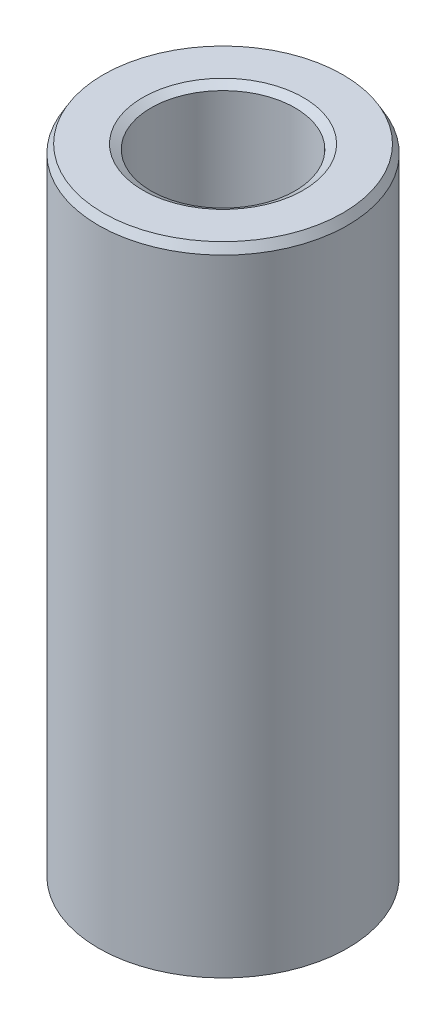
ISO-10303-21;
HEADER;
FILE_DESCRIPTION(('STEP AP214'),'2;1');
FILE_NAME('part.step','',(''),(''),'','','');
FILE_SCHEMA(('AUTOMOTIVE_DESIGN { 1 0 10303 214 1 1 1 1 }'));
ENDSEC;
DATA;
#1=APPLICATION_CONTEXT('core data for automotive mechanical design processes');
#2=APPLICATION_PROTOCOL_DEFINITION('international standard','automotive_design',2000,#1);
#3=PRODUCT_CONTEXT('',#1,'mechanical');
#4=PRODUCT('Part','Part','',(#3));
#5=PRODUCT_RELATED_PRODUCT_CATEGORY('part','',(#4));
#6=PRODUCT_DEFINITION_FORMATION('','',#4);
#7=PRODUCT_DEFINITION_CONTEXT('part definition',#1,'design');
#8=PRODUCT_DEFINITION('design','',#6,#7);
#9=PRODUCT_DEFINITION_SHAPE('','',#8);
#10=(LENGTH_UNIT() NAMED_UNIT(*) SI_UNIT(.MILLI.,.METRE.));
#11=(NAMED_UNIT(*) PLANE_ANGLE_UNIT() SI_UNIT($,.RADIAN.));
#12=(NAMED_UNIT(*) SI_UNIT($,.STERADIAN.) SOLID_ANGLE_UNIT());
#13=UNCERTAINTY_MEASURE_WITH_UNIT(LENGTH_MEASURE(1.E-05),#10,'distance_accuracy_value','');
#14=(GEOMETRIC_REPRESENTATION_CONTEXT(3) GLOBAL_UNCERTAINTY_ASSIGNED_CONTEXT((#13)) GLOBAL_UNIT_ASSIGNED_CONTEXT((#10,
#11,#12)) REPRESENTATION_CONTEXT('',''));
#15=CARTESIAN_POINT('',(0.,0.,0.));
#16=DIRECTION('',(0.,0.,1.));
#17=DIRECTION('',(1.,0.,0.));
#18=AXIS2_PLACEMENT_3D('',#15,#16,#17);
#19=CARTESIAN_POINT('',(0.,89.7518243447948,0.));
#20=DIRECTION('',(0.,-1.,0.));
#21=DIRECTION('',(0.,0.,-1.));
#22=AXIS2_PLACEMENT_3D('',#19,#20,#21);
#23=CYLINDRICAL_SURFACE('',#22,17.5);
#24=CARTESIAN_POINT('',(0.,0.672825133699442,0.));
#25=DIRECTION('',(0.,1.,0.));
#26=DIRECTION('',(0.,0.,1.));
#27=AXIS2_PLACEMENT_3D('',#24,#25,#26);
#28=CIRCLE('',#27,17.5);
#29=CARTESIAN_POINT('',(0.,0.672825133699442,17.5));
#30=VERTEX_POINT('',#29);
#31=EDGE_CURVE('E10',#30,#30,#28,.T.);
#32=ORIENTED_EDGE('',*,*,#31,.T.);
#33=EDGE_LOOP('',(#32));
#34=FACE_BOUND('',#33,.T.);
#35=CARTESIAN_POINT('',(0.,88.586457028618,0.));
#36=DIRECTION('',(0.,1.,0.));
#37=DIRECTION('',(0.,0.,1.));
#38=AXIS2_PLACEMENT_3D('',#35,#36,#37);
#39=CIRCLE('',#38,17.5);
#40=CARTESIAN_POINT('',(0.,88.586457028618,17.5));
#41=VERTEX_POINT('',#40);
#42=EDGE_CURVE('E50',#41,#41,#39,.F.);
#43=ORIENTED_EDGE('',*,*,#42,.T.);
#44=EDGE_LOOP('',(#43));
#45=FACE_BOUND('',#44,.T.);
#46=ADVANCED_FACE('F39',(#34,#45),#23,.T.);
#47=CARTESIAN_POINT('',(0.,89.7518243447948,0.));
#48=DIRECTION('',(0.,1.,0.));
#49=DIRECTION('',(0.,0.,1.));
#50=AXIS2_PLACEMENT_3D('',#47,#48,#49);
#51=PLANE('',#50);
#52=CARTESIAN_POINT('',(0.,89.7518243447948,0.));
#53=DIRECTION('',(0.,1.,0.));
#54=DIRECTION('',(0.,0.,1.));
#55=AXIS2_PLACEMENT_3D('',#52,#53,#54);
#56=CIRCLE('',#55,11.2804447194048);
#57=CARTESIAN_POINT('',(0.,89.7518243447948,11.2804447194048));
#58=VERTEX_POINT('',#57);
#59=EDGE_CURVE('E58',#58,#58,#56,.F.);
#60=ORIENTED_EDGE('',*,*,#59,.T.);
#61=EDGE_LOOP('',(#60));
#62=FACE_BOUND('',#61,.T.);
#63=CARTESIAN_POINT('',(0.,89.7518243447948,0.));
#64=DIRECTION('',(0.,1.,0.));
#65=DIRECTION('',(0.,0.,1.));
#66=AXIS2_PLACEMENT_3D('',#63,#64,#65);
#67=CIRCLE('',#66,16.8271748663005);
#68=CARTESIAN_POINT('',(0.,89.7518243447948,16.8271748663005));
#69=VERTEX_POINT('',#68);
#70=EDGE_CURVE('E61',#69,#69,#67,.T.);
#71=ORIENTED_EDGE('',*,*,#70,.T.);
#72=EDGE_LOOP('',(#71));
#73=FACE_BOUND('',#72,.T.);
#74=ADVANCED_FACE('F88',(#62,#73),#51,.T.);
#75=CARTESIAN_POINT('',(0.,0.,0.));
#76=DIRECTION('',(0.,1.,0.));
#77=DIRECTION('',(0.,0.,1.));
#78=AXIS2_PLACEMENT_3D('',#75,#76,#77);
#79=PLANE('',#78);
#80=CARTESIAN_POINT('',(0.,0.,0.));
#81=DIRECTION('',(0.,1.,0.));
#82=DIRECTION('',(0.,0.,1.));
#83=AXIS2_PLACEMENT_3D('',#80,#81,#82);
#84=CIRCLE('',#83,10.7879025369275);
#85=CARTESIAN_POINT('',(0.,0.,10.7879025369275));
#86=VERTEX_POINT('',#85);
#87=EDGE_CURVE('E51',#86,#86,#84,.T.);
#88=ORIENTED_EDGE('',*,*,#87,.T.);
#89=EDGE_LOOP('',(#88));
#90=FACE_BOUND('',#89,.T.);
#91=CARTESIAN_POINT('',(0.,0.,0.));
#92=DIRECTION('',(0.,1.,0.));
#93=DIRECTION('',(0.,0.,1.));
#94=AXIS2_PLACEMENT_3D('',#91,#92,#93);
#95=CIRCLE('',#94,16.3346326838232);
#96=CARTESIAN_POINT('',(0.,0.,16.3346326838232));
#97=VERTEX_POINT('',#96);
#98=EDGE_CURVE('E54',#97,#97,#95,.F.);
#99=ORIENTED_EDGE('',*,*,#98,.T.);
#100=EDGE_LOOP('',(#99));
#101=FACE_BOUND('',#100,.T.);
#102=ADVANCED_FACE('F83',(#90,#101),#79,.F.);
#103=CARTESIAN_POINT('',(0.,89.7518243447948,0.));
#104=DIRECTION('',(0.,-1.,0.));
#105=DIRECTION('',(0.,0.,-1.));
#106=AXIS2_PLACEMENT_3D('',#103,#104,#105);
#107=CYLINDRICAL_SURFACE('',#106,10.1150774032281);
#108=CARTESIAN_POINT('',(0.,89.0789992110954,0.));
#109=DIRECTION('',(0.,1.,0.));
#110=DIRECTION('',(0.,0.,1.));
#111=AXIS2_PLACEMENT_3D('',#108,#109,#110);
#112=CIRCLE('',#111,10.1150774032281);
#113=CARTESIAN_POINT('',(0.,89.0789992110953,10.1150774032281));
#114=VERTEX_POINT('',#113);
#115=EDGE_CURVE('E67',#114,#114,#112,.T.);
#116=ORIENTED_EDGE('',*,*,#115,.T.);
#117=EDGE_LOOP('',(#116));
#118=FACE_BOUND('',#117,.T.);
#119=CARTESIAN_POINT('',(0.,1.16536731617678,0.));
#120=DIRECTION('',(0.,1.,0.));
#121=DIRECTION('',(0.,0.,1.));
#122=AXIS2_PLACEMENT_3D('',#119,#120,#121);
#123=CIRCLE('',#122,10.1150774032281);
#124=CARTESIAN_POINT('',(0.,1.16536731617678,10.1150774032281));
#125=VERTEX_POINT('',#124);
#126=EDGE_CURVE('E69',#125,#125,#123,.F.);
#127=ORIENTED_EDGE('',*,*,#126,.T.);
#128=EDGE_LOOP('',(#127));
#129=FACE_BOUND('',#128,.T.);
#130=ADVANCED_FACE('F71',(#118,#129),#107,.F.);
#131=CARTESIAN_POINT('',(0.,89.0789992110954,0.));
#132=DIRECTION('',(0.,1.,0.));
#133=DIRECTION('',(0.,0.,1.));
#134=AXIS2_PLACEMENT_3D('',#131,#132,#133);
#135=CONICAL_SURFACE('',#134,10.1150774032281,1.0471975511966);
#136=CARTESIAN_POINT('',(0.,89.7518243447948,11.2804447194048));
#137=CARTESIAN_POINT('',(0.,89.7448157496521,11.268305476528));
#138=CARTESIAN_POINT('',(0.,89.7378071545094,11.2561662336511));
#139=CARTESIAN_POINT('',(0.,89.723789964224,11.2318877478975));
#140=CARTESIAN_POINT('',(0.,89.7167813690813,11.2197485050206));
#141=CARTESIAN_POINT('',(0.,89.7027641787959,11.1954700192669));
#142=CARTESIAN_POINT('',(0.,89.6957555836532,11.1833307763901));
#143=CARTESIAN_POINT('',(0.,89.6817383933678,11.1590522906364));
#144=CARTESIAN_POINT('',(0.,89.674729798225,11.1469130477596));
#145=CARTESIAN_POINT('',(0.,89.6607126079396,11.1226345620059));
#146=CARTESIAN_POINT('',(0.,89.653704012797,11.1104953191291));
#147=CARTESIAN_POINT('',(0.,89.6396868225115,11.0862168333754));
#148=CARTESIAN_POINT('',(0.,89.6326782273688,11.0740775904985));
#149=CARTESIAN_POINT('',(0.,89.6186610370834,11.0497991047448));
#150=CARTESIAN_POINT('',(0.,89.6116524419407,11.037659861868));
#151=CARTESIAN_POINT('',(0.,89.5976352516553,11.0133813761143));
#152=CARTESIAN_POINT('',(0.,89.5906266565126,11.0012421332375));
#153=CARTESIAN_POINT('',(0.,89.5766094662272,10.9769636474838));
#154=CARTESIAN_POINT('',(0.,89.5696008710845,10.964824404607));
#155=CARTESIAN_POINT('',(0.,89.5555836807991,10.9405459188533));
#156=CARTESIAN_POINT('',(0.,89.5485750856564,10.9284066759764));
#157=CARTESIAN_POINT('',(0.,89.534557895371,10.9041281902228));
#158=CARTESIAN_POINT('',(0.,89.5275493002283,10.8919889473459));
#159=CARTESIAN_POINT('',(0.,89.5135321099429,10.8677104615922));
#160=CARTESIAN_POINT('',(0.,89.5065235148002,10.8555712187154));
#161=CARTESIAN_POINT('',(0.,89.4925063245148,10.8312927329617));
#162=CARTESIAN_POINT('',(0.,89.4854977293721,10.8191534900849));
#163=CARTESIAN_POINT('',(0.,89.4714805390867,10.7948750043312));
#164=CARTESIAN_POINT('',(0.,89.464471943944,10.7827357614543));
#165=CARTESIAN_POINT('',(0.,89.4504547536586,10.7584572757007));
#166=CARTESIAN_POINT('',(0.,89.4434461585159,10.7463180328238));
#167=CARTESIAN_POINT('',(0.,89.4294289682305,10.7220395470701));
#168=CARTESIAN_POINT('',(0.,89.4224203730878,10.7099003041933));
#169=CARTESIAN_POINT('',(0.,89.4084031828024,10.6856218184396));
#170=CARTESIAN_POINT('',(0.,89.4013945876597,10.6734825755628));
#171=CARTESIAN_POINT('',(0.,89.3873773973743,10.6492040898091));
#172=CARTESIAN_POINT('',(0.,89.3803688022315,10.6370648469322));
#173=CARTESIAN_POINT('',(0.,89.3663516119461,10.6127863611786));
#174=CARTESIAN_POINT('',(0.,89.3593430168034,10.6006471183017));
#175=CARTESIAN_POINT('',(0.,89.345325826518,10.576368632548));
#176=CARTESIAN_POINT('',(0.,89.3383172313753,10.5642293896712));
#177=CARTESIAN_POINT('',(0.,89.3243000410899,10.5399509039175));
#178=CARTESIAN_POINT('',(0.,89.3172914459472,10.5278116610407));
#179=CARTESIAN_POINT('',(0.,89.3032742556618,10.503533175287));
#180=CARTESIAN_POINT('',(0.,89.2962656605191,10.4913939324102));
#181=CARTESIAN_POINT('',(0.,89.2822484702337,10.4671154466565));
#182=CARTESIAN_POINT('',(0.,89.275239875091,10.4549762037796));
#183=CARTESIAN_POINT('',(0.,89.2612226848056,10.430697718026));
#184=CARTESIAN_POINT('',(0.,89.2542140896629,10.4185584751491));
#185=CARTESIAN_POINT('',(0.,89.2401968993775,10.3942799893954));
#186=CARTESIAN_POINT('',(0.,89.2331883042348,10.3821407465186));
#187=CARTESIAN_POINT('',(0.,89.2191711139494,10.3578622607649));
#188=CARTESIAN_POINT('',(0.,89.2121625188067,10.3457230178881));
#189=CARTESIAN_POINT('',(0.,89.1981453285213,10.3214445321344));
#190=CARTESIAN_POINT('',(0.,89.1911367333786,10.3093052892575));
#191=CARTESIAN_POINT('',(0.,89.1771195430932,10.2850268035039));
#192=CARTESIAN_POINT('',(0.,89.1701109479505,10.272887560627));
#193=CARTESIAN_POINT('',(0.,89.1560937576651,10.2486090748733));
#194=CARTESIAN_POINT('',(0.,89.1490851625224,10.2364698319965));
#195=CARTESIAN_POINT('',(0.,89.135067972237,10.2121913462428));
#196=CARTESIAN_POINT('',(0.,89.1280593770943,10.200052103366));
#197=CARTESIAN_POINT('',(0.,89.1140421868089,10.1757736176123));
#198=CARTESIAN_POINT('',(0.,89.1070335916662,10.1636343747354));
#199=CARTESIAN_POINT('',(0.,89.0930164013808,10.1393558889818));
#200=CARTESIAN_POINT('',(0.,89.0860078062381,10.1272166461049));
#201=CARTESIAN_POINT('',(0.,89.0789992110954,10.1150774032281));
#202=B_SPLINE_CURVE_WITH_KNOTS('',3,(#136,#137,#138,#139,#140,#141,#142,#143,#144,#145,#146,
#147,#148,#149,#150,#151,#152,#153,#154,#155,#156,#157,#158,#159,#160,#161,#162,#163,#164,#165,
#166,#167,#168,#169,#170,#171,#172,#173,#174,#175,#176,#177,#178,#179,#180,#181,#182,#183,#184,
#185,#186,#187,#188,#189,#190,#191,#192,#193,#194,#195,#196,#197,#198,#199,#200,#201),
.UNSPECIFIED.,.F.,.F.,(4,2,2,2,2,2,2,2,2,2,2,2,2,2,2,2,2,2,2,2,2,2,2,2,2,2,2,2,2,2,2,2,4),(0.,
0.0420515708562132,0.0841031417124278,0.126154712568641,0.168206283424856,0.210257854281069,
0.252309425137284,0.294360995993497,0.336412566849717,0.378464137705932,0.420515708562145,
0.462567279418359,0.504618850274573,0.546670421130787,0.588721991987,0.630773562843214,
0.672825133699435,0.714876704555648,0.756928275411863,0.798979846268076,0.841031417124291,
0.883082987980504,0.925134558836719,0.967186129692932,1.00923770054915,1.05128927140537,
1.09334084226158,1.13539241311779,1.17744398397401,1.21949555483022,1.26154712568644,
1.30359869654265,1.34565026739886),.UNSPECIFIED.);
#203=EDGE_CURVE('BSEAM77',#58,#114,#202,.T.);
#204=ORIENTED_EDGE('',*,*,#59,.F.);
#205=ORIENTED_EDGE('',*,*,#115,.F.);
#206=ORIENTED_EDGE('',*,*,#203,.T.);
#207=ORIENTED_EDGE('',*,*,#203,.F.);
#208=EDGE_LOOP('',(#204,#206,#205,#207));
#209=FACE_BOUND('',#208,.T.);
#210=ADVANCED_FACE('F77',(#209),#135,.F.);
#211=CARTESIAN_POINT('',(0.,0.,0.));
#212=DIRECTION('',(0.,-1.,0.));
#213=DIRECTION('',(0.,0.,-1.));
#214=AXIS2_PLACEMENT_3D('',#211,#212,#213);
#215=CONICAL_SURFACE('',#214,10.7879025369275,0.523598775598293);
#216=ORIENTED_EDGE('',*,*,#126,.F.);
#217=EDGE_LOOP('',(#216));
#218=FACE_BOUND('',#217,.T.);
#219=ORIENTED_EDGE('',*,*,#87,.F.);
#220=EDGE_LOOP('',(#219));
#221=FACE_BOUND('',#220,.T.);
#222=ADVANCED_FACE('F73',(#218,#221),#215,.F.);
#223=CARTESIAN_POINT('',(0.,0.672825133699442,0.));
#224=DIRECTION('',(0.,1.,0.));
#225=DIRECTION('',(0.,0.,1.));
#226=AXIS2_PLACEMENT_3D('',#223,#224,#225);
#227=CONICAL_SURFACE('',#226,17.5,1.0471975511966);
#228=ORIENTED_EDGE('',*,*,#98,.F.);
#229=EDGE_LOOP('',(#228));
#230=FACE_BOUND('',#229,.T.);
#231=ORIENTED_EDGE('',*,*,#31,.F.);
#232=EDGE_LOOP('',(#231));
#233=FACE_BOUND('',#232,.T.);
#234=ADVANCED_FACE('F76',(#230,#233),#227,.T.);
#235=CARTESIAN_POINT('',(0.,89.7518243447948,0.));
#236=DIRECTION('',(0.,-1.,0.));
#237=DIRECTION('',(0.,0.,-1.));
#238=AXIS2_PLACEMENT_3D('',#235,#236,#237);
#239=CONICAL_SURFACE('',#238,16.8271748663005,0.523598775598296);
#240=ORIENTED_EDGE('',*,*,#42,.F.);
#241=EDGE_LOOP('',(#240));
#242=FACE_BOUND('',#241,.T.);
#243=ORIENTED_EDGE('',*,*,#70,.F.);
#244=EDGE_LOOP('',(#243));
#245=FACE_BOUND('',#244,.T.);
#246=ADVANCED_FACE('F45',(#242,#245),#239,.T.);
#247=CLOSED_SHELL('',(#46,#74,#102,#130,#210,#222,#234,#246));
#248=MANIFOLD_SOLID_BREP('B2',#247);
#249=ADVANCED_BREP_SHAPE_REPRESENTATION('',(#18,#248),#14);
#250=SHAPE_DEFINITION_REPRESENTATION(#9,#249);
ENDSEC;
END-ISO-10303-21;
